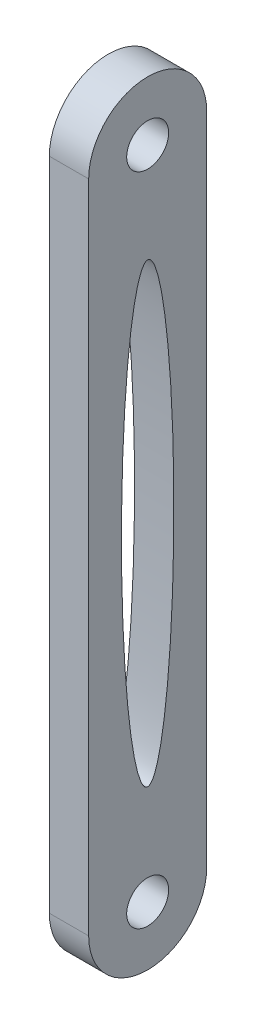
ISO-10303-21;
HEADER;
FILE_DESCRIPTION(('STEP AP214'),'2;1');
FILE_NAME('part.step','',(''),(''),'','','');
FILE_SCHEMA(('AUTOMOTIVE_DESIGN { 1 0 10303 214 1 1 1 1 }'));
ENDSEC;
DATA;
#1=APPLICATION_CONTEXT('core data for automotive mechanical design processes');
#2=APPLICATION_PROTOCOL_DEFINITION('international standard','automotive_design',2000,#1);
#3=PRODUCT_CONTEXT('',#1,'mechanical');
#4=PRODUCT('Part','Part','',(#3));
#5=PRODUCT_RELATED_PRODUCT_CATEGORY('part','',(#4));
#6=PRODUCT_DEFINITION_FORMATION('','',#4);
#7=PRODUCT_DEFINITION_CONTEXT('part definition',#1,'design');
#8=PRODUCT_DEFINITION('design','',#6,#7);
#9=PRODUCT_DEFINITION_SHAPE('','',#8);
#10=(LENGTH_UNIT() NAMED_UNIT(*) SI_UNIT(.MILLI.,.METRE.));
#11=(NAMED_UNIT(*) PLANE_ANGLE_UNIT() SI_UNIT($,.RADIAN.));
#12=(NAMED_UNIT(*) SI_UNIT($,.STERADIAN.) SOLID_ANGLE_UNIT());
#13=UNCERTAINTY_MEASURE_WITH_UNIT(LENGTH_MEASURE(1.E-05),#10,'distance_accuracy_value','');
#14=(GEOMETRIC_REPRESENTATION_CONTEXT(3) GLOBAL_UNCERTAINTY_ASSIGNED_CONTEXT((#13)) GLOBAL_UNIT_ASSIGNED_CONTEXT((#10,
#11,#12)) REPRESENTATION_CONTEXT('',''));
#15=CARTESIAN_POINT('',(0.,0.,0.));
#16=DIRECTION('',(0.,0.,1.));
#17=DIRECTION('',(1.,0.,0.));
#18=AXIS2_PLACEMENT_3D('',#15,#16,#17);
#19=CARTESIAN_POINT('',(3.,0.,0.));
#20=DIRECTION('',(-1.,0.,0.));
#21=DIRECTION('',(0.,0.,1.));
#22=AXIS2_PLACEMENT_3D('',#19,#20,#21);
#23=PLANE('',#22);
#24=CARTESIAN_POINT('',(3.,0.,0.));
#25=DIRECTION('',(1.,0.,0.));
#26=DIRECTION('',(0.,0.,1.));
#27=AXIS2_PLACEMENT_3D('',#24,#25,#26);
#28=CIRCLE('',#27,4.5);
#29=CARTESIAN_POINT('',(3.,0.,4.5));
#30=VERTEX_POINT('',#29);
#31=CARTESIAN_POINT('',(3.,0.,-4.5));
#32=VERTEX_POINT('',#31);
#33=EDGE_CURVE('E85',#30,#32,#28,.T.);
#34=ORIENTED_EDGE('',*,*,#33,.T.);
#35=DIRECTION('',(0.,1.,0.));
#36=VECTOR('',#35,1.);
#37=CARTESIAN_POINT('',(3.,0.,-4.5));
#38=LINE('',#37,#36);
#39=CARTESIAN_POINT('',(3.,50.,-4.5));
#40=VERTEX_POINT('',#39);
#41=EDGE_CURVE('E80',#32,#40,#38,.T.);
#42=ORIENTED_EDGE('',*,*,#41,.T.);
#43=CARTESIAN_POINT('',(3.,50.,0.));
#44=DIRECTION('',(1.,0.,0.));
#45=DIRECTION('',(0.,0.,-1.));
#46=AXIS2_PLACEMENT_3D('',#43,#44,#45);
#47=CIRCLE('',#46,4.5);
#48=CARTESIAN_POINT('',(3.,50.,4.5));
#49=VERTEX_POINT('',#48);
#50=EDGE_CURVE('E83',#40,#49,#47,.T.);
#51=ORIENTED_EDGE('',*,*,#50,.T.);
#52=DIRECTION('',(0.,-1.,0.));
#53=VECTOR('',#52,1.);
#54=CARTESIAN_POINT('',(3.,0.,4.5));
#55=LINE('',#54,#53);
#56=EDGE_CURVE('E50',#49,#30,#55,.T.);
#57=ORIENTED_EDGE('',*,*,#56,.T.);
#58=EDGE_LOOP('',(#34,#42,#51,#57));
#59=FACE_BOUND('',#58,.T.);
#60=CARTESIAN_POINT('',(3.,50.,0.));
#61=DIRECTION('',(1.,0.,0.));
#62=DIRECTION('',(0.,0.,-1.));
#63=AXIS2_PLACEMENT_3D('',#60,#61,#62);
#64=CIRCLE('',#63,1.6);
#65=CARTESIAN_POINT('',(3.,50.,-1.6));
#66=VERTEX_POINT('',#65);
#67=EDGE_CURVE('E100',#66,#66,#64,.T.);
#68=ORIENTED_EDGE('',*,*,#67,.F.);
#69=EDGE_LOOP('',(#68));
#70=FACE_BOUND('',#69,.T.);
#71=CARTESIAN_POINT('',(3.,0.,0.));
#72=DIRECTION('',(1.,0.,0.));
#73=DIRECTION('',(0.,0.,-1.));
#74=AXIS2_PLACEMENT_3D('',#71,#72,#73);
#75=CIRCLE('',#74,1.6);
#76=CARTESIAN_POINT('',(3.,0.,-1.6));
#77=VERTEX_POINT('',#76);
#78=EDGE_CURVE('E115',#77,#77,#75,.T.);
#79=ORIENTED_EDGE('',*,*,#78,.F.);
#80=EDGE_LOOP('',(#79));
#81=FACE_BOUND('',#80,.T.);
#82=CARTESIAN_POINT('',(3.,25.,0.));
#83=DIRECTION('',(1.,0.,0.));
#84=DIRECTION('',(0.,1.,0.));
#85=AXIS2_PLACEMENT_3D('',#82,#83,#84);
#86=ELLIPSE('',#85,17.4,2.);
#87=CARTESIAN_POINT('',(3.,42.4,0.));
#88=VERTEX_POINT('',#87);
#89=EDGE_CURVE('E121',#88,#88,#86,.T.);
#90=ORIENTED_EDGE('',*,*,#89,.F.);
#91=EDGE_LOOP('',(#90));
#92=FACE_BOUND('',#91,.T.);
#93=ADVANCED_FACE('F33',(#59,#70,#81,#92),#23,.F.);
#94=CARTESIAN_POINT('',(0.,0.,0.));
#95=DIRECTION('',(-1.,0.,0.));
#96=DIRECTION('',(0.,0.,1.));
#97=AXIS2_PLACEMENT_3D('',#94,#95,#96);
#98=PLANE('',#97);
#99=CARTESIAN_POINT('',(0.,0.,0.));
#100=DIRECTION('',(1.,0.,0.));
#101=DIRECTION('',(0.,0.,-1.));
#102=AXIS2_PLACEMENT_3D('',#99,#100,#101);
#103=CIRCLE('',#102,1.6);
#104=CARTESIAN_POINT('',(0.,0.,-1.6));
#105=VERTEX_POINT('',#104);
#106=EDGE_CURVE('E118',#105,#105,#103,.T.);
#107=ORIENTED_EDGE('',*,*,#106,.T.);
#108=EDGE_LOOP('',(#107));
#109=FACE_BOUND('',#108,.T.);
#110=CARTESIAN_POINT('',(0.,0.,0.));
#111=DIRECTION('',(1.,0.,0.));
#112=DIRECTION('',(0.,0.,1.));
#113=AXIS2_PLACEMENT_3D('',#110,#111,#112);
#114=CIRCLE('',#113,4.5);
#115=CARTESIAN_POINT('',(0.,0.,4.5));
#116=VERTEX_POINT('',#115);
#117=CARTESIAN_POINT('',(0.,0.,-4.5));
#118=VERTEX_POINT('',#117);
#119=EDGE_CURVE('E97',#116,#118,#114,.T.);
#120=ORIENTED_EDGE('',*,*,#119,.F.);
#121=DIRECTION('',(0.,-1.,0.));
#122=VECTOR('',#121,1.);
#123=CARTESIAN_POINT('',(0.,0.,4.5));
#124=LINE('',#123,#122);
#125=CARTESIAN_POINT('',(0.,50.,4.5));
#126=VERTEX_POINT('',#125);
#127=EDGE_CURVE('E73',#126,#116,#124,.T.);
#128=ORIENTED_EDGE('',*,*,#127,.F.);
#129=CARTESIAN_POINT('',(0.,50.,0.));
#130=DIRECTION('',(1.,0.,0.));
#131=DIRECTION('',(0.,0.,-1.));
#132=AXIS2_PLACEMENT_3D('',#129,#130,#131);
#133=CIRCLE('',#132,4.5);
#134=CARTESIAN_POINT('',(0.,50.,-4.5));
#135=VERTEX_POINT('',#134);
#136=EDGE_CURVE('E67',#135,#126,#133,.T.);
#137=ORIENTED_EDGE('',*,*,#136,.F.);
#138=DIRECTION('',(0.,1.,0.));
#139=VECTOR('',#138,1.);
#140=CARTESIAN_POINT('',(0.,0.,-4.5));
#141=LINE('',#140,#139);
#142=EDGE_CURVE('E89',#118,#135,#141,.T.);
#143=ORIENTED_EDGE('',*,*,#142,.F.);
#144=EDGE_LOOP('',(#120,#128,#137,#143));
#145=FACE_BOUND('',#144,.T.);
#146=CARTESIAN_POINT('',(0.,50.,0.));
#147=DIRECTION('',(1.,0.,0.));
#148=DIRECTION('',(0.,0.,-1.));
#149=AXIS2_PLACEMENT_3D('',#146,#147,#148);
#150=CIRCLE('',#149,1.6);
#151=CARTESIAN_POINT('',(0.,50.,-1.6));
#152=VERTEX_POINT('',#151);
#153=EDGE_CURVE('E112',#152,#152,#150,.T.);
#154=ORIENTED_EDGE('',*,*,#153,.T.);
#155=EDGE_LOOP('',(#154));
#156=FACE_BOUND('',#155,.T.);
#157=CARTESIAN_POINT('',(0.,25.,0.));
#158=DIRECTION('',(1.,0.,0.));
#159=DIRECTION('',(0.,1.,0.));
#160=AXIS2_PLACEMENT_3D('',#157,#158,#159);
#161=ELLIPSE('',#160,17.4,2.);
#162=CARTESIAN_POINT('',(0.,42.4,0.));
#163=VERTEX_POINT('',#162);
#164=EDGE_CURVE('E124',#163,#163,#161,.T.);
#165=ORIENTED_EDGE('',*,*,#164,.T.);
#166=EDGE_LOOP('',(#165));
#167=FACE_BOUND('',#166,.T.);
#168=ADVANCED_FACE('F108',(#109,#145,#156,#167),#98,.T.);
#169=CARTESIAN_POINT('',(3.,0.,0.));
#170=DIRECTION('',(-1.,0.,0.));
#171=DIRECTION('',(0.,0.,1.));
#172=AXIS2_PLACEMENT_3D('',#169,#170,#171);
#173=CYLINDRICAL_SURFACE('',#172,4.5);
#174=ORIENTED_EDGE('',*,*,#119,.T.);
#175=DIRECTION('',(-1.,0.,0.));
#176=VECTOR('',#175,1.);
#177=CARTESIAN_POINT('',(3.,0.,-4.5));
#178=LINE('',#177,#176);
#179=EDGE_CURVE('E11',#32,#118,#178,.T.);
#180=ORIENTED_EDGE('',*,*,#179,.F.);
#181=ORIENTED_EDGE('',*,*,#33,.F.);
#182=DIRECTION('',(-1.,0.,0.));
#183=VECTOR('',#182,1.);
#184=CARTESIAN_POINT('',(3.,0.,4.5));
#185=LINE('',#184,#183);
#186=EDGE_CURVE('E93',#30,#116,#185,.T.);
#187=ORIENTED_EDGE('',*,*,#186,.T.);
#188=EDGE_LOOP('',(#174,#180,#181,#187));
#189=FACE_BOUND('',#188,.T.);
#190=ADVANCED_FACE('F35',(#189),#173,.T.);
#191=CARTESIAN_POINT('',(3.,0.,-4.5));
#192=DIRECTION('',(0.,0.,1.));
#193=DIRECTION('',(1.,0.,0.));
#194=AXIS2_PLACEMENT_3D('',#191,#192,#193);
#195=PLANE('',#194);
#196=ORIENTED_EDGE('',*,*,#142,.T.);
#197=DIRECTION('',(-1.,0.,0.));
#198=VECTOR('',#197,1.);
#199=CARTESIAN_POINT('',(3.,50.,-4.5));
#200=LINE('',#199,#198);
#201=EDGE_CURVE('E42',#40,#135,#200,.T.);
#202=ORIENTED_EDGE('',*,*,#201,.F.);
#203=ORIENTED_EDGE('',*,*,#41,.F.);
#204=ORIENTED_EDGE('',*,*,#179,.T.);
#205=EDGE_LOOP('',(#196,#202,#203,#204));
#206=FACE_BOUND('',#205,.T.);
#207=ADVANCED_FACE('F88',(#206),#195,.F.);
#208=CARTESIAN_POINT('',(3.,50.,0.));
#209=DIRECTION('',(-1.,0.,0.));
#210=DIRECTION('',(0.,0.,1.));
#211=AXIS2_PLACEMENT_3D('',#208,#209,#210);
#212=CYLINDRICAL_SURFACE('',#211,4.5);
#213=ORIENTED_EDGE('',*,*,#136,.T.);
#214=DIRECTION('',(-1.,0.,0.));
#215=VECTOR('',#214,1.);
#216=CARTESIAN_POINT('',(3.,50.,4.5));
#217=LINE('',#216,#215);
#218=EDGE_CURVE('E90',#49,#126,#217,.T.);
#219=ORIENTED_EDGE('',*,*,#218,.F.);
#220=ORIENTED_EDGE('',*,*,#50,.F.);
#221=ORIENTED_EDGE('',*,*,#201,.T.);
#222=EDGE_LOOP('',(#213,#219,#220,#221));
#223=FACE_BOUND('',#222,.T.);
#224=ADVANCED_FACE('F91',(#223),#212,.T.);
#225=CARTESIAN_POINT('',(3.,0.,4.5));
#226=DIRECTION('',(0.,0.,-1.));
#227=DIRECTION('',(-1.,0.,0.));
#228=AXIS2_PLACEMENT_3D('',#225,#226,#227);
#229=PLANE('',#228);
#230=ORIENTED_EDGE('',*,*,#127,.T.);
#231=ORIENTED_EDGE('',*,*,#186,.F.);
#232=ORIENTED_EDGE('',*,*,#56,.F.);
#233=ORIENTED_EDGE('',*,*,#218,.T.);
#234=EDGE_LOOP('',(#230,#231,#232,#233));
#235=FACE_BOUND('',#234,.T.);
#236=ADVANCED_FACE('F105',(#235),#229,.F.);
#237=CARTESIAN_POINT('',(3.,50.,0.));
#238=DIRECTION('',(-1.,0.,0.));
#239=DIRECTION('',(0.,0.,1.));
#240=AXIS2_PLACEMENT_3D('',#237,#238,#239);
#241=CYLINDRICAL_SURFACE('',#240,1.6);
#242=ORIENTED_EDGE('',*,*,#67,.T.);
#243=EDGE_LOOP('',(#242));
#244=FACE_BOUND('',#243,.T.);
#245=ORIENTED_EDGE('',*,*,#153,.F.);
#246=EDGE_LOOP('',(#245));
#247=FACE_BOUND('',#246,.T.);
#248=ADVANCED_FACE('F137',(#244,#247),#241,.F.);
#249=CARTESIAN_POINT('',(3.,0.,0.));
#250=DIRECTION('',(-1.,0.,0.));
#251=DIRECTION('',(0.,0.,1.));
#252=AXIS2_PLACEMENT_3D('',#249,#250,#251);
#253=CYLINDRICAL_SURFACE('',#252,1.6);
#254=ORIENTED_EDGE('',*,*,#78,.T.);
#255=EDGE_LOOP('',(#254));
#256=FACE_BOUND('',#255,.T.);
#257=ORIENTED_EDGE('',*,*,#106,.F.);
#258=EDGE_LOOP('',(#257));
#259=FACE_BOUND('',#258,.T.);
#260=ADVANCED_FACE('F133',(#256,#259),#253,.F.);
#261=DIRECTION('',(-1.,0.,0.));
#262=VECTOR('',#261,1.);
#263=SURFACE_OF_LINEAR_EXTRUSION('',#86,#262);
#264=ORIENTED_EDGE('',*,*,#89,.T.);
#265=EDGE_LOOP('',(#264));
#266=FACE_BOUND('',#265,.T.);
#267=ORIENTED_EDGE('',*,*,#164,.F.);
#268=EDGE_LOOP('',(#267));
#269=FACE_BOUND('',#268,.T.);
#270=ADVANCED_FACE('F130',(#266,#269),#263,.T.);
#271=CLOSED_SHELL('',(#93,#168,#190,#207,#224,#236,#248,#260,#270));
#272=MANIFOLD_SOLID_BREP('B2',#271);
#273=ADVANCED_BREP_SHAPE_REPRESENTATION('',(#18,#272),#14);
#274=SHAPE_DEFINITION_REPRESENTATION(#9,#273);
ENDSEC;
END-ISO-10303-21;
